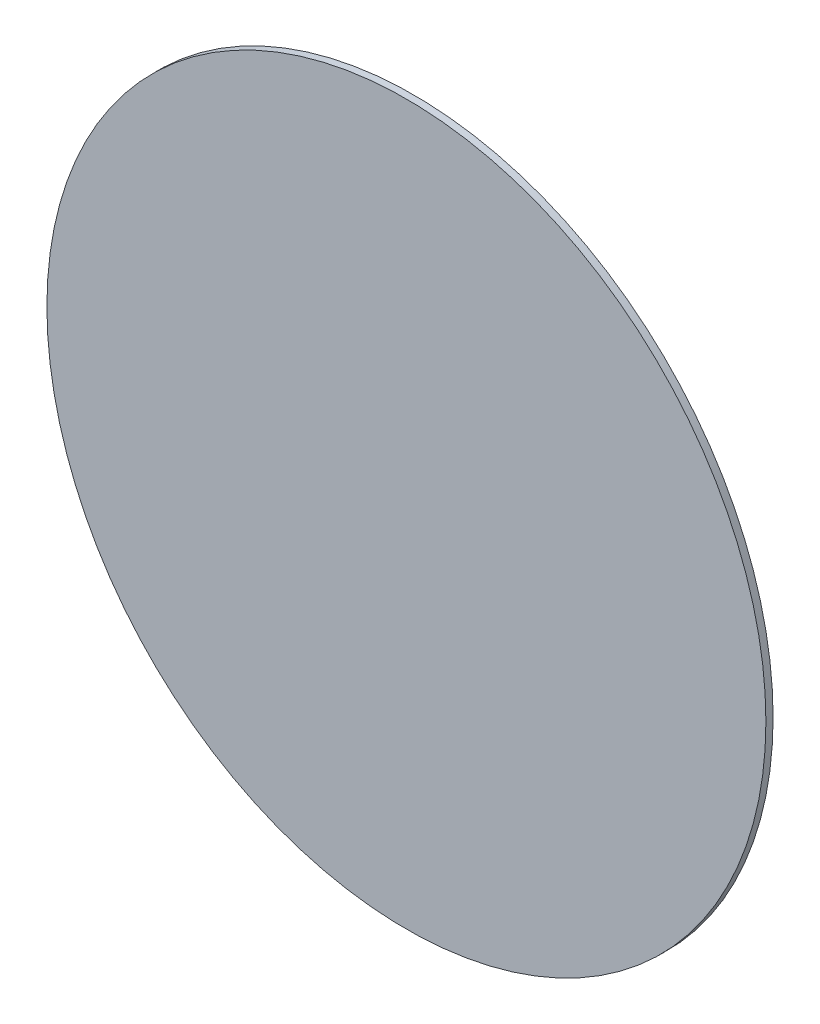
ISO-10303-21;
HEADER;
FILE_DESCRIPTION(('STEP AP214'),'2;1');
FILE_NAME('part.step','',(''),(''),'','','');
FILE_SCHEMA(('AUTOMOTIVE_DESIGN { 1 0 10303 214 1 1 1 1 }'));
ENDSEC;
DATA;
#1=APPLICATION_CONTEXT('core data for automotive mechanical design processes');
#2=APPLICATION_PROTOCOL_DEFINITION('international standard','automotive_design',2000,#1);
#3=PRODUCT_CONTEXT('',#1,'mechanical');
#4=PRODUCT('Part','Part','',(#3));
#5=PRODUCT_RELATED_PRODUCT_CATEGORY('part','',(#4));
#6=PRODUCT_DEFINITION_FORMATION('','',#4);
#7=PRODUCT_DEFINITION_CONTEXT('part definition',#1,'design');
#8=PRODUCT_DEFINITION('design','',#6,#7);
#9=PRODUCT_DEFINITION_SHAPE('','',#8);
#10=(LENGTH_UNIT() NAMED_UNIT(*) SI_UNIT(.MILLI.,.METRE.));
#11=(NAMED_UNIT(*) PLANE_ANGLE_UNIT() SI_UNIT($,.RADIAN.));
#12=(NAMED_UNIT(*) SI_UNIT($,.STERADIAN.) SOLID_ANGLE_UNIT());
#13=UNCERTAINTY_MEASURE_WITH_UNIT(LENGTH_MEASURE(1.E-05),#10,'distance_accuracy_value','');
#14=(GEOMETRIC_REPRESENTATION_CONTEXT(3) GLOBAL_UNCERTAINTY_ASSIGNED_CONTEXT((#13)) GLOBAL_UNIT_ASSIGNED_CONTEXT((#10,
#11,#12)) REPRESENTATION_CONTEXT('',''));
#15=CARTESIAN_POINT('',(0.,0.,0.));
#16=DIRECTION('',(0.,0.,1.));
#17=DIRECTION('',(1.,0.,0.));
#18=AXIS2_PLACEMENT_3D('',#15,#16,#17);
#19=CARTESIAN_POINT('',(0.20928469030963,0.593156667970284,0.));
#20=DIRECTION('',(0.,0.,1.));
#21=DIRECTION('',(1.,0.,0.));
#22=AXIS2_PLACEMENT_3D('',#19,#20,#21);
#23=CYLINDRICAL_SURFACE('',#22,0.15);
#24=CARTESIAN_POINT('',(0.20928469030963,0.593156667970284,0.003));
#25=DIRECTION('',(0.,0.,1.));
#26=DIRECTION('',(1.,0.,0.));
#27=AXIS2_PLACEMENT_3D('',#24,#25,#26);
#28=CIRCLE('',#27,0.15);
#29=CARTESIAN_POINT('',(0.35928469030963,0.593156667970284,0.003));
#30=VERTEX_POINT('',#29);
#31=CARTESIAN_POINT('',(0.0592846903096302,0.593156667970284,0.003));
#32=VERTEX_POINT('',#31);
#33=EDGE_CURVE('E11',#30,#32,#28,.T.);
#34=ORIENTED_EDGE('',*,*,#33,.F.);
#35=CARTESIAN_POINT('',(0.20928469030963,0.593156667970284,0.003));
#36=DIRECTION('',(0.,0.,1.));
#37=DIRECTION('',(1.,0.,0.));
#38=AXIS2_PLACEMENT_3D('',#35,#36,#37);
#39=CIRCLE('',#38,0.15);
#40=EDGE_CURVE('E24',#32,#30,#39,.T.);
#41=ORIENTED_EDGE('',*,*,#40,.F.);
#42=DIRECTION('',(0.,0.,-1.));
#43=VECTOR('',#42,1.);
#44=CARTESIAN_POINT('',(0.0592846903096302,0.593156667970284,0.));
#45=LINE('',#44,#43);
#46=CARTESIAN_POINT('',(0.0592846903096302,0.593156667970284,0.));
#47=VERTEX_POINT('',#46);
#48=EDGE_CURVE('E43',#32,#47,#45,.T.);
#49=ORIENTED_EDGE('',*,*,#48,.T.);
#50=CARTESIAN_POINT('',(0.20928469030963,0.593156667970284,0.));
#51=DIRECTION('',(0.,0.,1.));
#52=DIRECTION('',(1.,0.,0.));
#53=AXIS2_PLACEMENT_3D('',#50,#51,#52);
#54=CIRCLE('',#53,0.15);
#55=CARTESIAN_POINT('',(0.35928469030963,0.593156667970284,0.));
#56=VERTEX_POINT('',#55);
#57=EDGE_CURVE('E40',#47,#56,#54,.T.);
#58=ORIENTED_EDGE('',*,*,#57,.T.);
#59=CARTESIAN_POINT('',(0.20928469030963,0.593156667970284,0.));
#60=DIRECTION('',(0.,0.,1.));
#61=DIRECTION('',(1.,0.,0.));
#62=AXIS2_PLACEMENT_3D('',#59,#60,#61);
#63=CIRCLE('',#62,0.15);
#64=EDGE_CURVE('E42',#56,#47,#63,.T.);
#65=ORIENTED_EDGE('',*,*,#64,.T.);
#66=ORIENTED_EDGE('',*,*,#48,.F.);
#67=EDGE_LOOP('',(#34,#41,#49,#58,#65,#66));
#68=FACE_BOUND('',#67,.T.);
#69=ADVANCED_FACE('F17',(#68),#23,.T.);
#70=CARTESIAN_POINT('',(0.20928469030963,0.593156667970284,0.003));
#71=DIRECTION('',(0.,0.,1.));
#72=DIRECTION('',(1.,0.,0.));
#73=AXIS2_PLACEMENT_3D('',#70,#71,#72);
#74=PLANE('',#73);
#75=ORIENTED_EDGE('',*,*,#33,.T.);
#76=ORIENTED_EDGE('',*,*,#40,.T.);
#77=EDGE_LOOP('',(#75,#76));
#78=FACE_BOUND('',#77,.T.);
#79=ADVANCED_FACE('F49',(#78),#74,.T.);
#80=CARTESIAN_POINT('',(0.20928469030963,0.593156667970284,0.));
#81=DIRECTION('',(0.,0.,1.));
#82=DIRECTION('',(1.,0.,0.));
#83=AXIS2_PLACEMENT_3D('',#80,#81,#82);
#84=PLANE('',#83);
#85=ORIENTED_EDGE('',*,*,#64,.F.);
#86=ORIENTED_EDGE('',*,*,#57,.F.);
#87=EDGE_LOOP('',(#85,#86));
#88=FACE_BOUND('',#87,.T.);
#89=ADVANCED_FACE('F46',(#88),#84,.F.);
#90=CLOSED_SHELL('',(#69,#79,#89));
#91=MANIFOLD_SOLID_BREP('B1',#90);
#92=ADVANCED_BREP_SHAPE_REPRESENTATION('',(#18,#91),#14);
#93=SHAPE_DEFINITION_REPRESENTATION(#9,#92);
ENDSEC;
END-ISO-10303-21;
